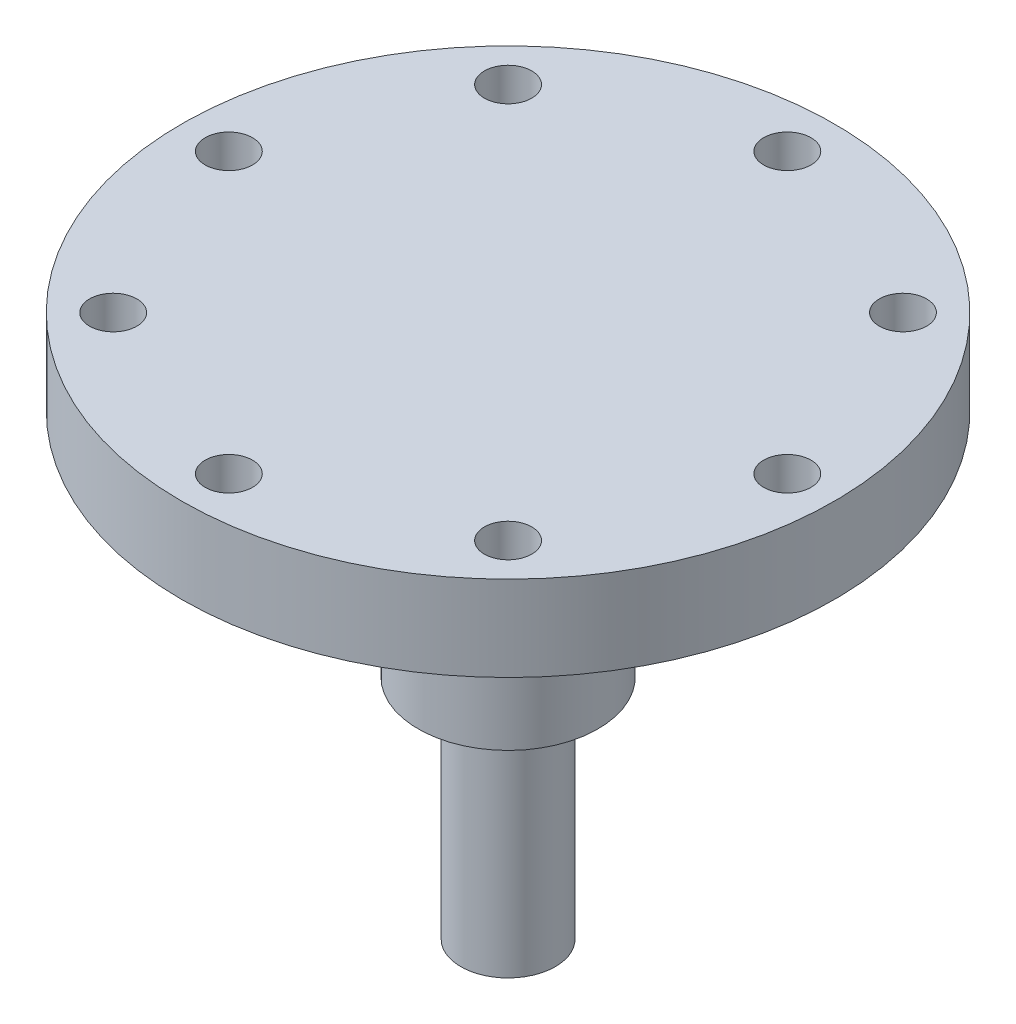
ISO-10303-21;
HEADER;
FILE_DESCRIPTION(('STEP AP214'),'2;1');
FILE_NAME('part.step','',(''),(''),'','','');
FILE_SCHEMA(('AUTOMOTIVE_DESIGN { 1 0 10303 214 1 1 1 1 }'));
ENDSEC;
DATA;
#1=APPLICATION_CONTEXT('core data for automotive mechanical design processes');
#2=APPLICATION_PROTOCOL_DEFINITION('international standard','automotive_design',2000,#1);
#3=PRODUCT_CONTEXT('',#1,'mechanical');
#4=PRODUCT('Part','Part','',(#3));
#5=PRODUCT_RELATED_PRODUCT_CATEGORY('part','',(#4));
#6=PRODUCT_DEFINITION_FORMATION('','',#4);
#7=PRODUCT_DEFINITION_CONTEXT('part definition',#1,'design');
#8=PRODUCT_DEFINITION('design','',#6,#7);
#9=PRODUCT_DEFINITION_SHAPE('','',#8);
#10=(LENGTH_UNIT() NAMED_UNIT(*) SI_UNIT(.MILLI.,.METRE.));
#11=(NAMED_UNIT(*) PLANE_ANGLE_UNIT() SI_UNIT($,.RADIAN.));
#12=(NAMED_UNIT(*) SI_UNIT($,.STERADIAN.) SOLID_ANGLE_UNIT());
#13=UNCERTAINTY_MEASURE_WITH_UNIT(LENGTH_MEASURE(1.E-05),#10,'distance_accuracy_value','');
#14=(GEOMETRIC_REPRESENTATION_CONTEXT(3) GLOBAL_UNCERTAINTY_ASSIGNED_CONTEXT((#13)) GLOBAL_UNIT_ASSIGNED_CONTEXT((#10,
#11,#12)) REPRESENTATION_CONTEXT('',''));
#15=CARTESIAN_POINT('',(0.,0.,0.));
#16=DIRECTION('',(0.,0.,1.));
#17=DIRECTION('',(1.,0.,0.));
#18=AXIS2_PLACEMENT_3D('',#15,#16,#17);
#19=CARTESIAN_POINT('',(0.,4.5,0.));
#20=DIRECTION('',(0.,1.,0.));
#21=DIRECTION('',(0.,0.,1.));
#22=AXIS2_PLACEMENT_3D('',#19,#20,#21);
#23=PLANE('',#22);
#24=CARTESIAN_POINT('',(1.54498049243809E-13,4.5,-14.75));
#25=DIRECTION('',(0.,1.,0.));
#26=DIRECTION('',(0.,0.,1.));
#27=AXIS2_PLACEMENT_3D('',#24,#25,#26);
#28=CIRCLE('',#27,1.25);
#29=CARTESIAN_POINT('',(1.54498049243809E-13,4.5,-13.5));
#30=VERTEX_POINT('',#29);
#31=EDGE_CURVE('E60',#30,#30,#28,.T.);
#32=ORIENTED_EDGE('',*,*,#31,.F.);
#33=EDGE_LOOP('',(#32));
#34=FACE_BOUND('',#33,.T.);
#35=CARTESIAN_POINT('',(-14.75,4.5,-1.02998699495872E-13));
#36=DIRECTION('',(0.,1.,0.));
#37=DIRECTION('',(0.,0.,1.));
#38=AXIS2_PLACEMENT_3D('',#35,#36,#37);
#39=CIRCLE('',#38,1.25);
#40=CARTESIAN_POINT('',(-14.75,4.5,1.2499999999999));
#41=VERTEX_POINT('',#40);
#42=EDGE_CURVE('E72',#41,#41,#39,.T.);
#43=ORIENTED_EDGE('',*,*,#42,.F.);
#44=EDGE_LOOP('',(#43));
#45=FACE_BOUND('',#44,.T.);
#46=CARTESIAN_POINT('',(0.,4.5,14.75));
#47=DIRECTION('',(0.,1.,0.));
#48=DIRECTION('',(0.,0.,1.));
#49=AXIS2_PLACEMENT_3D('',#46,#47,#48);
#50=CIRCLE('',#49,1.25);
#51=CARTESIAN_POINT('',(0.,4.5,16.));
#52=VERTEX_POINT('',#51);
#53=EDGE_CURVE('E84',#52,#52,#50,.T.);
#54=ORIENTED_EDGE('',*,*,#53,.F.);
#55=EDGE_LOOP('',(#54));
#56=FACE_BOUND('',#55,.T.);
#57=CARTESIAN_POINT('',(14.75,4.5,0.));
#58=DIRECTION('',(0.,1.,0.));
#59=DIRECTION('',(0.,0.,1.));
#60=AXIS2_PLACEMENT_3D('',#57,#58,#59);
#61=CIRCLE('',#60,1.25);
#62=CARTESIAN_POINT('',(14.75,4.5,1.25));
#63=VERTEX_POINT('',#62);
#64=EDGE_CURVE('E96',#63,#63,#61,.T.);
#65=ORIENTED_EDGE('',*,*,#64,.F.);
#66=EDGE_LOOP('',(#65));
#67=FACE_BOUND('',#66,.T.);
#68=CARTESIAN_POINT('',(0.,4.5,0.));
#69=DIRECTION('',(0.,1.,0.));
#70=DIRECTION('',(0.,0.,1.));
#71=AXIS2_PLACEMENT_3D('',#68,#69,#70);
#72=CIRCLE('',#71,17.25);
#73=CARTESIAN_POINT('',(0.,4.5,17.25));
#74=VERTEX_POINT('',#73);
#75=EDGE_CURVE('E42',#74,#74,#72,.T.);
#76=ORIENTED_EDGE('',*,*,#75,.T.);
#77=EDGE_LOOP('',(#76));
#78=FACE_BOUND('',#77,.T.);
#79=CARTESIAN_POINT('',(10.4298250225016,4.5,10.4298250225016));
#80=DIRECTION('',(0.,1.,0.));
#81=DIRECTION('',(0.,0.,1.));
#82=AXIS2_PLACEMENT_3D('',#79,#80,#81);
#83=CIRCLE('',#82,1.25);
#84=CARTESIAN_POINT('',(10.4298250225016,4.5,11.6798250225016));
#85=VERTEX_POINT('',#84);
#86=EDGE_CURVE('E90',#85,#85,#83,.T.);
#87=ORIENTED_EDGE('',*,*,#86,.F.);
#88=EDGE_LOOP('',(#87));
#89=FACE_BOUND('',#88,.T.);
#90=CARTESIAN_POINT('',(-10.4298250225016,4.5,10.4298250225015));
#91=DIRECTION('',(0.,1.,0.));
#92=DIRECTION('',(0.,0.,1.));
#93=AXIS2_PLACEMENT_3D('',#90,#91,#92);
#94=CIRCLE('',#93,1.25);
#95=CARTESIAN_POINT('',(-10.4298250225016,4.5,11.6798250225015));
#96=VERTEX_POINT('',#95);
#97=EDGE_CURVE('E78',#96,#96,#94,.T.);
#98=ORIENTED_EDGE('',*,*,#97,.F.);
#99=EDGE_LOOP('',(#98));
#100=FACE_BOUND('',#99,.T.);
#101=CARTESIAN_POINT('',(-10.4298250225015,4.5,-10.4298250225017));
#102=DIRECTION('',(0.,1.,0.));
#103=DIRECTION('',(0.,0.,1.));
#104=AXIS2_PLACEMENT_3D('',#101,#102,#103);
#105=CIRCLE('',#104,1.25);
#106=CARTESIAN_POINT('',(-10.4298250225015,4.5,-9.17982502250167));
#107=VERTEX_POINT('',#106);
#108=EDGE_CURVE('E66',#107,#107,#105,.T.);
#109=ORIENTED_EDGE('',*,*,#108,.F.);
#110=EDGE_LOOP('',(#109));
#111=FACE_BOUND('',#110,.T.);
#112=CARTESIAN_POINT('',(10.4298250225017,4.5,-10.4298250225014));
#113=DIRECTION('',(0.,1.,0.));
#114=DIRECTION('',(0.,0.,1.));
#115=AXIS2_PLACEMENT_3D('',#112,#113,#114);
#116=CIRCLE('',#115,1.25);
#117=CARTESIAN_POINT('',(10.4298250225017,4.5,-9.17982502250145));
#118=VERTEX_POINT('',#117);
#119=EDGE_CURVE('E54',#118,#118,#116,.T.);
#120=ORIENTED_EDGE('',*,*,#119,.F.);
#121=EDGE_LOOP('',(#120));
#122=FACE_BOUND('',#121,.T.);
#123=ADVANCED_FACE('F30',(#34,#45,#56,#67,#78,#89,#100,#111,#122),#23,.T.);
#124=CARTESIAN_POINT('',(0.,0.,0.));
#125=DIRECTION('',(0.,1.,0.));
#126=DIRECTION('',(0.,0.,1.));
#127=AXIS2_PLACEMENT_3D('',#124,#125,#126);
#128=PLANE('',#127);
#129=CARTESIAN_POINT('',(0.,0.,0.));
#130=DIRECTION('',(0.,1.,0.));
#131=DIRECTION('',(0.,0.,1.));
#132=AXIS2_PLACEMENT_3D('',#129,#130,#131);
#133=CIRCLE('',#132,6.);
#134=CARTESIAN_POINT('',(0.,0.,6.));
#135=VERTEX_POINT('',#134);
#136=EDGE_CURVE('E34',#135,#135,#133,.F.);
#137=ORIENTED_EDGE('',*,*,#136,.F.);
#138=EDGE_LOOP('',(#137));
#139=FACE_BOUND('',#138,.T.);
#140=CARTESIAN_POINT('',(0.,0.,0.));
#141=DIRECTION('',(0.,1.,0.));
#142=DIRECTION('',(0.,0.,1.));
#143=AXIS2_PLACEMENT_3D('',#140,#141,#142);
#144=CIRCLE('',#143,17.25);
#145=CARTESIAN_POINT('',(0.,0.,17.25));
#146=VERTEX_POINT('',#145);
#147=EDGE_CURVE('E99',#146,#146,#144,.T.);
#148=ORIENTED_EDGE('',*,*,#147,.F.);
#149=EDGE_LOOP('',(#148));
#150=FACE_BOUND('',#149,.T.);
#151=CARTESIAN_POINT('',(14.75,0.,0.));
#152=DIRECTION('',(0.,1.,0.));
#153=DIRECTION('',(0.,0.,1.));
#154=AXIS2_PLACEMENT_3D('',#151,#152,#153);
#155=CIRCLE('',#154,1.25);
#156=CARTESIAN_POINT('',(14.75,0.,1.25));
#157=VERTEX_POINT('',#156);
#158=EDGE_CURVE('E93',#157,#157,#155,.T.);
#159=ORIENTED_EDGE('',*,*,#158,.T.);
#160=EDGE_LOOP('',(#159));
#161=FACE_BOUND('',#160,.T.);
#162=CARTESIAN_POINT('',(10.4298250225016,0.,10.4298250225016));
#163=DIRECTION('',(0.,1.,0.));
#164=DIRECTION('',(0.,0.,1.));
#165=AXIS2_PLACEMENT_3D('',#162,#163,#164);
#166=CIRCLE('',#165,1.25);
#167=CARTESIAN_POINT('',(10.4298250225016,0.,11.6798250225016));
#168=VERTEX_POINT('',#167);
#169=EDGE_CURVE('E87',#168,#168,#166,.T.);
#170=ORIENTED_EDGE('',*,*,#169,.T.);
#171=EDGE_LOOP('',(#170));
#172=FACE_BOUND('',#171,.T.);
#173=CARTESIAN_POINT('',(0.,0.,14.75));
#174=DIRECTION('',(0.,1.,0.));
#175=DIRECTION('',(0.,0.,1.));
#176=AXIS2_PLACEMENT_3D('',#173,#174,#175);
#177=CIRCLE('',#176,1.25);
#178=CARTESIAN_POINT('',(0.,0.,16.));
#179=VERTEX_POINT('',#178);
#180=EDGE_CURVE('E81',#179,#179,#177,.T.);
#181=ORIENTED_EDGE('',*,*,#180,.T.);
#182=EDGE_LOOP('',(#181));
#183=FACE_BOUND('',#182,.T.);
#184=CARTESIAN_POINT('',(-10.4298250225016,0.,10.4298250225015));
#185=DIRECTION('',(0.,1.,0.));
#186=DIRECTION('',(0.,0.,1.));
#187=AXIS2_PLACEMENT_3D('',#184,#185,#186);
#188=CIRCLE('',#187,1.25);
#189=CARTESIAN_POINT('',(-10.4298250225016,0.,11.6798250225015));
#190=VERTEX_POINT('',#189);
#191=EDGE_CURVE('E75',#190,#190,#188,.T.);
#192=ORIENTED_EDGE('',*,*,#191,.T.);
#193=EDGE_LOOP('',(#192));
#194=FACE_BOUND('',#193,.T.);
#195=CARTESIAN_POINT('',(-14.75,0.,-1.02998699495872E-13));
#196=DIRECTION('',(0.,1.,0.));
#197=DIRECTION('',(0.,0.,1.));
#198=AXIS2_PLACEMENT_3D('',#195,#196,#197);
#199=CIRCLE('',#198,1.25);
#200=CARTESIAN_POINT('',(-14.75,0.,1.2499999999999));
#201=VERTEX_POINT('',#200);
#202=EDGE_CURVE('E69',#201,#201,#199,.T.);
#203=ORIENTED_EDGE('',*,*,#202,.T.);
#204=EDGE_LOOP('',(#203));
#205=FACE_BOUND('',#204,.T.);
#206=CARTESIAN_POINT('',(-10.4298250225015,0.,-10.4298250225017));
#207=DIRECTION('',(0.,1.,0.));
#208=DIRECTION('',(0.,0.,1.));
#209=AXIS2_PLACEMENT_3D('',#206,#207,#208);
#210=CIRCLE('',#209,1.25);
#211=CARTESIAN_POINT('',(-10.4298250225015,0.,-9.17982502250167));
#212=VERTEX_POINT('',#211);
#213=EDGE_CURVE('E63',#212,#212,#210,.T.);
#214=ORIENTED_EDGE('',*,*,#213,.T.);
#215=EDGE_LOOP('',(#214));
#216=FACE_BOUND('',#215,.T.);
#217=CARTESIAN_POINT('',(1.54498049243809E-13,0.,-14.75));
#218=DIRECTION('',(0.,1.,0.));
#219=DIRECTION('',(0.,0.,1.));
#220=AXIS2_PLACEMENT_3D('',#217,#218,#219);
#221=CIRCLE('',#220,1.25);
#222=CARTESIAN_POINT('',(1.54498049243809E-13,0.,-13.5));
#223=VERTEX_POINT('',#222);
#224=EDGE_CURVE('E57',#223,#223,#221,.T.);
#225=ORIENTED_EDGE('',*,*,#224,.T.);
#226=EDGE_LOOP('',(#225));
#227=FACE_BOUND('',#226,.T.);
#228=CARTESIAN_POINT('',(10.4298250225017,0.,-10.4298250225014));
#229=DIRECTION('',(0.,1.,0.));
#230=DIRECTION('',(0.,0.,1.));
#231=AXIS2_PLACEMENT_3D('',#228,#229,#230);
#232=CIRCLE('',#231,1.25);
#233=CARTESIAN_POINT('',(10.4298250225017,0.,-9.17982502250145));
#234=VERTEX_POINT('',#233);
#235=EDGE_CURVE('E53',#234,#234,#232,.T.);
#236=ORIENTED_EDGE('',*,*,#235,.T.);
#237=EDGE_LOOP('',(#236));
#238=FACE_BOUND('',#237,.T.);
#239=ADVANCED_FACE('F125',(#139,#150,#161,#172,#183,#194,#205,#216,#227,#238),#128,.F.);
#240=CARTESIAN_POINT('',(0.,4.5,0.));
#241=DIRECTION('',(0.,-1.,0.));
#242=DIRECTION('',(0.,0.,-1.));
#243=AXIS2_PLACEMENT_3D('',#240,#241,#242);
#244=CYLINDRICAL_SURFACE('',#243,17.25);
#245=ORIENTED_EDGE('',*,*,#75,.F.);
#246=EDGE_LOOP('',(#245));
#247=FACE_BOUND('',#246,.T.);
#248=ORIENTED_EDGE('',*,*,#147,.T.);
#249=EDGE_LOOP('',(#248));
#250=FACE_BOUND('',#249,.T.);
#251=ADVANCED_FACE('F32',(#247,#250),#244,.T.);
#252=CARTESIAN_POINT('',(14.75,4.5,0.));
#253=DIRECTION('',(0.,-1.,0.));
#254=DIRECTION('',(0.,0.,-1.));
#255=AXIS2_PLACEMENT_3D('',#252,#253,#254);
#256=CYLINDRICAL_SURFACE('',#255,1.25);
#257=ORIENTED_EDGE('',*,*,#64,.T.);
#258=EDGE_LOOP('',(#257));
#259=FACE_BOUND('',#258,.T.);
#260=ORIENTED_EDGE('',*,*,#158,.F.);
#261=EDGE_LOOP('',(#260));
#262=FACE_BOUND('',#261,.T.);
#263=ADVANCED_FACE('F165',(#259,#262),#256,.F.);
#264=CARTESIAN_POINT('',(10.4298250225016,4.5,10.4298250225016));
#265=DIRECTION('',(0.,-1.,0.));
#266=DIRECTION('',(0.,0.,-1.));
#267=AXIS2_PLACEMENT_3D('',#264,#265,#266);
#268=CYLINDRICAL_SURFACE('',#267,1.25);
#269=ORIENTED_EDGE('',*,*,#86,.T.);
#270=EDGE_LOOP('',(#269));
#271=FACE_BOUND('',#270,.T.);
#272=ORIENTED_EDGE('',*,*,#169,.F.);
#273=EDGE_LOOP('',(#272));
#274=FACE_BOUND('',#273,.T.);
#275=ADVANCED_FACE('F168',(#271,#274),#268,.F.);
#276=CARTESIAN_POINT('',(0.,4.5,14.75));
#277=DIRECTION('',(0.,-1.,0.));
#278=DIRECTION('',(0.,0.,-1.));
#279=AXIS2_PLACEMENT_3D('',#276,#277,#278);
#280=CYLINDRICAL_SURFACE('',#279,1.25);
#281=ORIENTED_EDGE('',*,*,#53,.T.);
#282=EDGE_LOOP('',(#281));
#283=FACE_BOUND('',#282,.T.);
#284=ORIENTED_EDGE('',*,*,#180,.F.);
#285=EDGE_LOOP('',(#284));
#286=FACE_BOUND('',#285,.T.);
#287=ADVANCED_FACE('F172',(#283,#286),#280,.F.);
#288=CARTESIAN_POINT('',(-10.4298250225016,4.5,10.4298250225015));
#289=DIRECTION('',(0.,-1.,0.));
#290=DIRECTION('',(0.,0.,-1.));
#291=AXIS2_PLACEMENT_3D('',#288,#289,#290);
#292=CYLINDRICAL_SURFACE('',#291,1.25);
#293=ORIENTED_EDGE('',*,*,#97,.T.);
#294=EDGE_LOOP('',(#293));
#295=FACE_BOUND('',#294,.T.);
#296=ORIENTED_EDGE('',*,*,#191,.F.);
#297=EDGE_LOOP('',(#296));
#298=FACE_BOUND('',#297,.T.);
#299=ADVANCED_FACE('F176',(#295,#298),#292,.F.);
#300=CARTESIAN_POINT('',(-14.75,4.5,-1.02998699495872E-13));
#301=DIRECTION('',(0.,-1.,0.));
#302=DIRECTION('',(0.,0.,-1.));
#303=AXIS2_PLACEMENT_3D('',#300,#301,#302);
#304=CYLINDRICAL_SURFACE('',#303,1.25);
#305=ORIENTED_EDGE('',*,*,#42,.T.);
#306=EDGE_LOOP('',(#305));
#307=FACE_BOUND('',#306,.T.);
#308=ORIENTED_EDGE('',*,*,#202,.F.);
#309=EDGE_LOOP('',(#308));
#310=FACE_BOUND('',#309,.T.);
#311=ADVANCED_FACE('F180',(#307,#310),#304,.F.);
#312=CARTESIAN_POINT('',(-10.4298250225015,4.5,-10.4298250225017));
#313=DIRECTION('',(0.,-1.,0.));
#314=DIRECTION('',(0.,0.,-1.));
#315=AXIS2_PLACEMENT_3D('',#312,#313,#314);
#316=CYLINDRICAL_SURFACE('',#315,1.25);
#317=ORIENTED_EDGE('',*,*,#108,.T.);
#318=EDGE_LOOP('',(#317));
#319=FACE_BOUND('',#318,.T.);
#320=ORIENTED_EDGE('',*,*,#213,.F.);
#321=EDGE_LOOP('',(#320));
#322=FACE_BOUND('',#321,.T.);
#323=ADVANCED_FACE('F153',(#319,#322),#316,.F.);
#324=CARTESIAN_POINT('',(1.54498049243809E-13,4.5,-14.75));
#325=DIRECTION('',(0.,-1.,0.));
#326=DIRECTION('',(0.,0.,-1.));
#327=AXIS2_PLACEMENT_3D('',#324,#325,#326);
#328=CYLINDRICAL_SURFACE('',#327,1.25);
#329=ORIENTED_EDGE('',*,*,#31,.T.);
#330=EDGE_LOOP('',(#329));
#331=FACE_BOUND('',#330,.T.);
#332=ORIENTED_EDGE('',*,*,#224,.F.);
#333=EDGE_LOOP('',(#332));
#334=FACE_BOUND('',#333,.T.);
#335=ADVANCED_FACE('F147',(#331,#334),#328,.F.);
#336=CARTESIAN_POINT('',(10.4298250225017,4.5,-10.4298250225014));
#337=DIRECTION('',(0.,-1.,0.));
#338=DIRECTION('',(0.,0.,-1.));
#339=AXIS2_PLACEMENT_3D('',#336,#337,#338);
#340=CYLINDRICAL_SURFACE('',#339,1.25);
#341=ORIENTED_EDGE('',*,*,#119,.T.);
#342=EDGE_LOOP('',(#341));
#343=FACE_BOUND('',#342,.T.);
#344=ORIENTED_EDGE('',*,*,#235,.F.);
#345=EDGE_LOOP('',(#344));
#346=FACE_BOUND('',#345,.T.);
#347=ADVANCED_FACE('F121',(#343,#346),#340,.F.);
#348=CARTESIAN_POINT('',(0.,-3.,0.));
#349=DIRECTION('',(0.,1.,0.));
#350=DIRECTION('',(0.,0.,1.));
#351=AXIS2_PLACEMENT_3D('',#348,#349,#350);
#352=CYLINDRICAL_SURFACE('',#351,6.);
#353=CARTESIAN_POINT('',(0.,-3.,0.));
#354=DIRECTION('',(0.,-1.,0.));
#355=DIRECTION('',(0.,0.,-1.));
#356=AXIS2_PLACEMENT_3D('',#353,#354,#355);
#357=CIRCLE('',#356,6.);
#358=CARTESIAN_POINT('',(0.,-3.,-6.));
#359=VERTEX_POINT('',#358);
#360=EDGE_CURVE('E46',#359,#359,#357,.T.);
#361=ORIENTED_EDGE('',*,*,#360,.F.);
#362=EDGE_LOOP('',(#361));
#363=FACE_BOUND('',#362,.T.);
#364=ORIENTED_EDGE('',*,*,#136,.T.);
#365=EDGE_LOOP('',(#364));
#366=FACE_BOUND('',#365,.T.);
#367=ADVANCED_FACE('F115',(#363,#366),#352,.T.);
#368=CARTESIAN_POINT('',(0.,-3.,0.));
#369=DIRECTION('',(0.,-1.,0.));
#370=DIRECTION('',(0.,0.,-1.));
#371=AXIS2_PLACEMENT_3D('',#368,#369,#370);
#372=PLANE('',#371);
#373=CARTESIAN_POINT('',(0.,-3.,0.));
#374=DIRECTION('',(0.,-1.,0.));
#375=DIRECTION('',(0.,0.,-1.));
#376=AXIS2_PLACEMENT_3D('',#373,#374,#375);
#377=CIRCLE('',#376,4.75);
#378=CARTESIAN_POINT('',(0.,-3.,-4.75));
#379=VERTEX_POINT('',#378);
#380=EDGE_CURVE('E49',#379,#379,#377,.T.);
#381=ORIENTED_EDGE('',*,*,#380,.F.);
#382=EDGE_LOOP('',(#381));
#383=FACE_BOUND('',#382,.T.);
#384=ORIENTED_EDGE('',*,*,#360,.T.);
#385=EDGE_LOOP('',(#384));
#386=FACE_BOUND('',#385,.T.);
#387=ADVANCED_FACE('F111',(#383,#386),#372,.T.);
#388=CARTESIAN_POINT('',(0.,-12.175,0.));
#389=DIRECTION('',(0.,-1.,0.));
#390=DIRECTION('',(0.,0.,-1.));
#391=AXIS2_PLACEMENT_3D('',#388,#389,#390);
#392=PLANE('',#391);
#393=CARTESIAN_POINT('',(0.,-12.175,0.));
#394=DIRECTION('',(0.,-1.,0.));
#395=DIRECTION('',(0.,0.,-1.));
#396=AXIS2_PLACEMENT_3D('',#393,#394,#395);
#397=CIRCLE('',#396,2.5);
#398=CARTESIAN_POINT('',(0.,-12.175,-2.5));
#399=VERTEX_POINT('',#398);
#400=EDGE_CURVE('E10',#399,#399,#397,.T.);
#401=ORIENTED_EDGE('',*,*,#400,.F.);
#402=EDGE_LOOP('',(#401));
#403=FACE_BOUND('',#402,.T.);
#404=CARTESIAN_POINT('',(0.,-12.175,0.));
#405=DIRECTION('',(0.,-1.,0.));
#406=DIRECTION('',(0.,0.,-1.));
#407=AXIS2_PLACEMENT_3D('',#404,#405,#406);
#408=CIRCLE('',#407,4.75);
#409=CARTESIAN_POINT('',(0.,-12.175,-4.75));
#410=VERTEX_POINT('',#409);
#411=EDGE_CURVE('E50',#410,#410,#408,.T.);
#412=ORIENTED_EDGE('',*,*,#411,.T.);
#413=EDGE_LOOP('',(#412));
#414=FACE_BOUND('',#413,.T.);
#415=ADVANCED_FACE('F114',(#403,#414),#392,.T.);
#416=CARTESIAN_POINT('',(0.,-12.175,0.));
#417=DIRECTION('',(0.,1.,0.));
#418=DIRECTION('',(0.,0.,1.));
#419=AXIS2_PLACEMENT_3D('',#416,#417,#418);
#420=CYLINDRICAL_SURFACE('',#419,4.75);
#421=ORIENTED_EDGE('',*,*,#380,.T.);
#422=EDGE_LOOP('',(#421));
#423=FACE_BOUND('',#422,.T.);
#424=ORIENTED_EDGE('',*,*,#411,.F.);
#425=EDGE_LOOP('',(#424));
#426=FACE_BOUND('',#425,.T.);
#427=ADVANCED_FACE('F108',(#423,#426),#420,.T.);
#428=CARTESIAN_POINT('',(0.,-24.175,0.));
#429=DIRECTION('',(0.,1.,0.));
#430=DIRECTION('',(0.,0.,1.));
#431=AXIS2_PLACEMENT_3D('',#428,#429,#430);
#432=CYLINDRICAL_SURFACE('',#431,2.5);
#433=CARTESIAN_POINT('',(0.,-24.175,0.));
#434=DIRECTION('',(0.,-1.,0.));
#435=DIRECTION('',(0.,0.,-1.));
#436=AXIS2_PLACEMENT_3D('',#433,#434,#435);
#437=CIRCLE('',#436,2.5);
#438=CARTESIAN_POINT('',(0.,-24.175,-2.5));
#439=VERTEX_POINT('',#438);
#440=EDGE_CURVE('E45',#439,#439,#437,.T.);
#441=ORIENTED_EDGE('',*,*,#440,.F.);
#442=EDGE_LOOP('',(#441));
#443=FACE_BOUND('',#442,.T.);
#444=ORIENTED_EDGE('',*,*,#400,.T.);
#445=EDGE_LOOP('',(#444));
#446=FACE_BOUND('',#445,.T.);
#447=ADVANCED_FACE('F237',(#443,#446),#432,.T.);
#448=CARTESIAN_POINT('',(0.,-24.175,0.));
#449=DIRECTION('',(0.,-1.,0.));
#450=DIRECTION('',(0.,0.,-1.));
#451=AXIS2_PLACEMENT_3D('',#448,#449,#450);
#452=PLANE('',#451);
#453=ORIENTED_EDGE('',*,*,#440,.T.);
#454=EDGE_LOOP('',(#453));
#455=FACE_BOUND('',#454,.T.);
#456=ADVANCED_FACE('F251',(#455),#452,.T.);
#457=CLOSED_SHELL('',(#123,#239,#251,#263,#275,#287,#299,#311,#323,#335,#347,#367,#387,#415,
#427,#447,#456));
#458=MANIFOLD_SOLID_BREP('B2',#457);
#459=ADVANCED_BREP_SHAPE_REPRESENTATION('',(#18,#458),#14);
#460=SHAPE_DEFINITION_REPRESENTATION(#9,#459);
ENDSEC;
END-ISO-10303-21;
